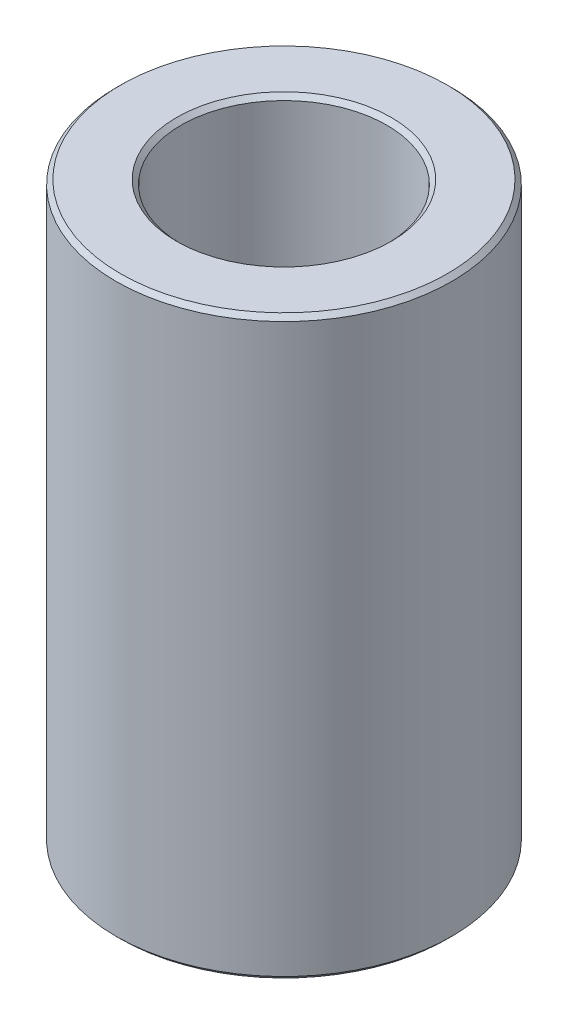
ISO-10303-21;
HEADER;
FILE_DESCRIPTION(('STEP AP214'),'2;1');
FILE_NAME('part.step','',(''),(''),'','','');
FILE_SCHEMA(('AUTOMOTIVE_DESIGN { 1 0 10303 214 1 1 1 1 }'));
ENDSEC;
DATA;
#1=APPLICATION_CONTEXT('core data for automotive mechanical design processes');
#2=APPLICATION_PROTOCOL_DEFINITION('international standard','automotive_design',2000,#1);
#3=PRODUCT_CONTEXT('',#1,'mechanical');
#4=PRODUCT('Part','Part','',(#3));
#5=PRODUCT_RELATED_PRODUCT_CATEGORY('part','',(#4));
#6=PRODUCT_DEFINITION_FORMATION('','',#4);
#7=PRODUCT_DEFINITION_CONTEXT('part definition',#1,'design');
#8=PRODUCT_DEFINITION('design','',#6,#7);
#9=PRODUCT_DEFINITION_SHAPE('','',#8);
#10=(LENGTH_UNIT() NAMED_UNIT(*) SI_UNIT(.MILLI.,.METRE.));
#11=(NAMED_UNIT(*) PLANE_ANGLE_UNIT() SI_UNIT($,.RADIAN.));
#12=(NAMED_UNIT(*) SI_UNIT($,.STERADIAN.) SOLID_ANGLE_UNIT());
#13=UNCERTAINTY_MEASURE_WITH_UNIT(LENGTH_MEASURE(1.E-05),#10,'distance_accuracy_value','');
#14=(GEOMETRIC_REPRESENTATION_CONTEXT(3) GLOBAL_UNCERTAINTY_ASSIGNED_CONTEXT((#13)) GLOBAL_UNIT_ASSIGNED_CONTEXT((#10,
#11,#12)) REPRESENTATION_CONTEXT('',''));
#15=CARTESIAN_POINT('',(0.,0.,0.));
#16=DIRECTION('',(0.,0.,1.));
#17=DIRECTION('',(1.,0.,0.));
#18=AXIS2_PLACEMENT_3D('',#15,#16,#17);
#19=CARTESIAN_POINT('',(0.,145.853794204156,0.));
#20=DIRECTION('',(0.,-1.,0.));
#21=DIRECTION('',(0.,0.,-1.));
#22=AXIS2_PLACEMENT_3D('',#19,#20,#21);
#23=CYLINDRICAL_SURFACE('',#22,42.5);
#24=CARTESIAN_POINT('',(0.,1.12929743052465,0.));
#25=DIRECTION('',(0.,1.,0.));
#26=DIRECTION('',(0.,0.,1.));
#27=AXIS2_PLACEMENT_3D('',#24,#25,#26);
#28=CIRCLE('',#27,42.5);
#29=CARTESIAN_POINT('',(0.,1.12929743052465,42.5));
#30=VERTEX_POINT('',#29);
#31=EDGE_CURVE('E10',#30,#30,#28,.T.);
#32=ORIENTED_EDGE('',*,*,#31,.T.);
#33=EDGE_LOOP('',(#32));
#34=FACE_BOUND('',#33,.T.);
#35=CARTESIAN_POINT('',(0.,144.724496773631,0.));
#36=DIRECTION('',(0.,1.,0.));
#37=DIRECTION('',(0.,0.,1.));
#38=AXIS2_PLACEMENT_3D('',#35,#36,#37);
#39=CIRCLE('',#38,42.5);
#40=CARTESIAN_POINT('',(0.,144.724496773631,42.5));
#41=VERTEX_POINT('',#40);
#42=EDGE_CURVE('E50',#41,#41,#39,.F.);
#43=ORIENTED_EDGE('',*,*,#42,.T.);
#44=EDGE_LOOP('',(#43));
#45=FACE_BOUND('',#44,.T.);
#46=ADVANCED_FACE('F39',(#34,#45),#23,.T.);
#47=CARTESIAN_POINT('',(0.,145.853794204156,0.));
#48=DIRECTION('',(0.,1.,0.));
#49=DIRECTION('',(0.,0.,1.));
#50=AXIS2_PLACEMENT_3D('',#47,#48,#49);
#51=PLANE('',#50);
#52=CARTESIAN_POINT('',(0.,145.853794204156,0.));
#53=DIRECTION('',(0.,1.,0.));
#54=DIRECTION('',(0.,0.,1.));
#55=AXIS2_PLACEMENT_3D('',#52,#53,#54);
#56=CIRCLE('',#55,27.1802863039371);
#57=CARTESIAN_POINT('',(0.,145.853794204156,27.1802863039371));
#58=VERTEX_POINT('',#57);
#59=EDGE_CURVE('E58',#58,#58,#56,.F.);
#60=ORIENTED_EDGE('',*,*,#59,.T.);
#61=EDGE_LOOP('',(#60));
#62=FACE_BOUND('',#61,.T.);
#63=CARTESIAN_POINT('',(0.,145.853794204156,0.));
#64=DIRECTION('',(0.,1.,0.));
#65=DIRECTION('',(0.,0.,1.));
#66=AXIS2_PLACEMENT_3D('',#63,#64,#65);
#67=CIRCLE('',#66,41.3707025694754);
#68=CARTESIAN_POINT('',(0.,145.853794204156,41.3707025694754));
#69=VERTEX_POINT('',#68);
#70=EDGE_CURVE('E61',#69,#69,#67,.T.);
#71=ORIENTED_EDGE('',*,*,#70,.T.);
#72=EDGE_LOOP('',(#71));
#73=FACE_BOUND('',#72,.T.);
#74=ADVANCED_FACE('F88',(#62,#73),#51,.T.);
#75=CARTESIAN_POINT('',(0.,0.,0.));
#76=DIRECTION('',(0.,1.,0.));
#77=DIRECTION('',(0.,0.,1.));
#78=AXIS2_PLACEMENT_3D('',#75,#76,#77);
#79=PLANE('',#78);
#80=CARTESIAN_POINT('',(0.,0.,0.));
#81=DIRECTION('',(0.,1.,0.));
#82=DIRECTION('',(0.,0.,1.));
#83=AXIS2_PLACEMENT_3D('',#80,#81,#82);
#84=CIRCLE('',#83,27.1802863039371);
#85=CARTESIAN_POINT('',(0.,0.,27.1802863039371));
#86=VERTEX_POINT('',#85);
#87=EDGE_CURVE('E51',#86,#86,#84,.T.);
#88=ORIENTED_EDGE('',*,*,#87,.T.);
#89=EDGE_LOOP('',(#88));
#90=FACE_BOUND('',#89,.T.);
#91=CARTESIAN_POINT('',(0.,0.,0.));
#92=DIRECTION('',(0.,1.,0.));
#93=DIRECTION('',(0.,0.,1.));
#94=AXIS2_PLACEMENT_3D('',#91,#92,#93);
#95=CIRCLE('',#94,41.3707025694754);
#96=CARTESIAN_POINT('',(0.,0.,41.3707025694754));
#97=VERTEX_POINT('',#96);
#98=EDGE_CURVE('E54',#97,#97,#95,.F.);
#99=ORIENTED_EDGE('',*,*,#98,.T.);
#100=EDGE_LOOP('',(#99));
#101=FACE_BOUND('',#100,.T.);
#102=ADVANCED_FACE('F83',(#90,#101),#79,.F.);
#103=CARTESIAN_POINT('',(0.,145.853794204156,0.));
#104=DIRECTION('',(0.,-1.,0.));
#105=DIRECTION('',(0.,0.,-1.));
#106=AXIS2_PLACEMENT_3D('',#103,#104,#105);
#107=CYLINDRICAL_SURFACE('',#106,26.0509888734125);
#108=CARTESIAN_POINT('',(0.,144.724496773631,0.));
#109=DIRECTION('',(0.,1.,0.));
#110=DIRECTION('',(0.,0.,1.));
#111=AXIS2_PLACEMENT_3D('',#108,#109,#110);
#112=CIRCLE('',#111,26.0509888734125);
#113=CARTESIAN_POINT('',(0.,144.724496773631,26.0509888734125));
#114=VERTEX_POINT('',#113);
#115=EDGE_CURVE('E67',#114,#114,#112,.T.);
#116=ORIENTED_EDGE('',*,*,#115,.T.);
#117=EDGE_LOOP('',(#116));
#118=FACE_BOUND('',#117,.T.);
#119=CARTESIAN_POINT('',(0.,1.12929743052462,0.));
#120=DIRECTION('',(0.,1.,0.));
#121=DIRECTION('',(0.,0.,1.));
#122=AXIS2_PLACEMENT_3D('',#119,#120,#121);
#123=CIRCLE('',#122,26.0509888734125);
#124=CARTESIAN_POINT('',(0.,1.12929743052462,26.0509888734125));
#125=VERTEX_POINT('',#124);
#126=EDGE_CURVE('E69',#125,#125,#123,.F.);
#127=ORIENTED_EDGE('',*,*,#126,.T.);
#128=EDGE_LOOP('',(#127));
#129=FACE_BOUND('',#128,.T.);
#130=ADVANCED_FACE('F71',(#118,#129),#107,.F.);
#131=CARTESIAN_POINT('',(0.,144.724496773631,0.));
#132=DIRECTION('',(0.,1.,0.));
#133=DIRECTION('',(0.,0.,1.));
#134=AXIS2_PLACEMENT_3D('',#131,#132,#133);
#135=CONICAL_SURFACE('',#134,26.0509888734125,0.785398163397442);
#136=ORIENTED_EDGE('',*,*,#59,.F.);
#137=EDGE_LOOP('',(#136));
#138=FACE_BOUND('',#137,.T.);
#139=ORIENTED_EDGE('',*,*,#115,.F.);
#140=EDGE_LOOP('',(#139));
#141=FACE_BOUND('',#140,.T.);
#142=ADVANCED_FACE('F77',(#138,#141),#135,.F.);
#143=CARTESIAN_POINT('',(0.,0.,0.));
#144=DIRECTION('',(0.,-1.,0.));
#145=DIRECTION('',(0.,0.,-1.));
#146=AXIS2_PLACEMENT_3D('',#143,#144,#145);
#147=CONICAL_SURFACE('',#146,27.1802863039371,0.785398163397448);
#148=ORIENTED_EDGE('',*,*,#126,.F.);
#149=EDGE_LOOP('',(#148));
#150=FACE_BOUND('',#149,.T.);
#151=ORIENTED_EDGE('',*,*,#87,.F.);
#152=EDGE_LOOP('',(#151));
#153=FACE_BOUND('',#152,.T.);
#154=ADVANCED_FACE('F73',(#150,#153),#147,.F.);
#155=CARTESIAN_POINT('',(0.,1.12929743052465,0.));
#156=DIRECTION('',(0.,1.,0.));
#157=DIRECTION('',(0.,0.,1.));
#158=AXIS2_PLACEMENT_3D('',#155,#156,#157);
#159=CONICAL_SURFACE('',#158,42.5,0.785398163397448);
#160=ORIENTED_EDGE('',*,*,#98,.F.);
#161=EDGE_LOOP('',(#160));
#162=FACE_BOUND('',#161,.T.);
#163=ORIENTED_EDGE('',*,*,#31,.F.);
#164=EDGE_LOOP('',(#163));
#165=FACE_BOUND('',#164,.T.);
#166=ADVANCED_FACE('F76',(#162,#165),#159,.T.);
#167=CARTESIAN_POINT('',(0.,145.853794204156,0.));
#168=DIRECTION('',(0.,-1.,0.));
#169=DIRECTION('',(0.,0.,-1.));
#170=AXIS2_PLACEMENT_3D('',#167,#168,#169);
#171=CONICAL_SURFACE('',#170,41.3707025694754,0.785398163397448);
#172=ORIENTED_EDGE('',*,*,#42,.F.);
#173=EDGE_LOOP('',(#172));
#174=FACE_BOUND('',#173,.T.);
#175=ORIENTED_EDGE('',*,*,#70,.F.);
#176=EDGE_LOOP('',(#175));
#177=FACE_BOUND('',#176,.T.);
#178=ADVANCED_FACE('F45',(#174,#177),#171,.T.);
#179=CLOSED_SHELL('',(#46,#74,#102,#130,#142,#154,#166,#178));
#180=MANIFOLD_SOLID_BREP('B2',#179);
#181=ADVANCED_BREP_SHAPE_REPRESENTATION('',(#18,#180),#14);
#182=SHAPE_DEFINITION_REPRESENTATION(#9,#181);
ENDSEC;
END-ISO-10303-21;
